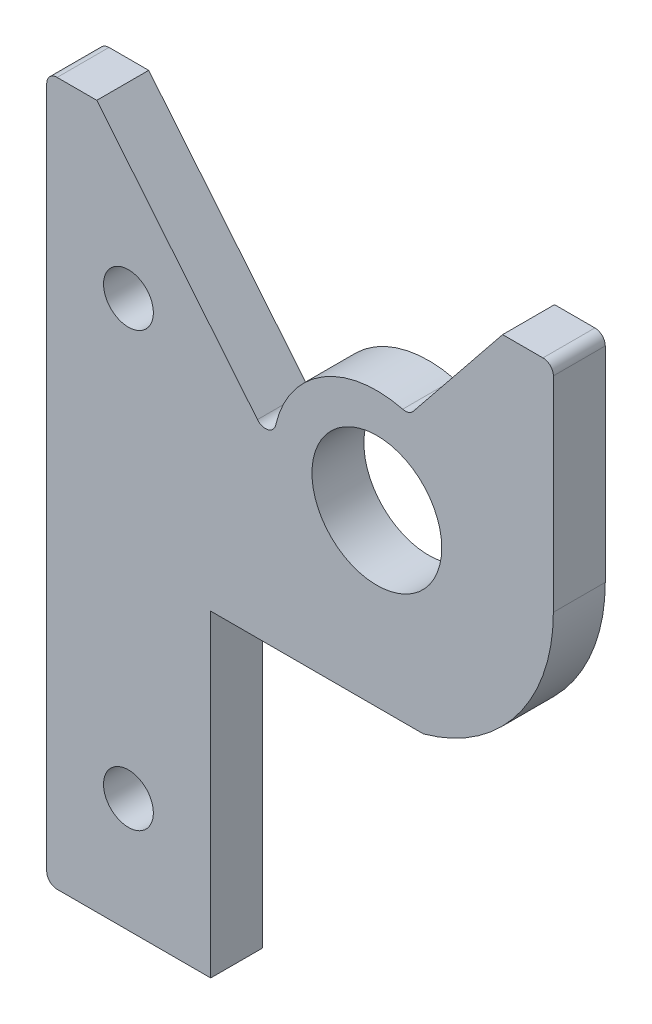
ISO-10303-21;
HEADER;
FILE_DESCRIPTION(('STEP AP214'),'2;1');
FILE_NAME('part.step','',(''),(''),'','','');
FILE_SCHEMA(('AUTOMOTIVE_DESIGN { 1 0 10303 214 1 1 1 1 }'));
ENDSEC;
DATA;
#1=APPLICATION_CONTEXT('core data for automotive mechanical design processes');
#2=APPLICATION_PROTOCOL_DEFINITION('international standard','automotive_design',2000,#1);
#3=PRODUCT_CONTEXT('',#1,'mechanical');
#4=PRODUCT('Part','Part','',(#3));
#5=PRODUCT_RELATED_PRODUCT_CATEGORY('part','',(#4));
#6=PRODUCT_DEFINITION_FORMATION('','',#4);
#7=PRODUCT_DEFINITION_CONTEXT('part definition',#1,'design');
#8=PRODUCT_DEFINITION('design','',#6,#7);
#9=PRODUCT_DEFINITION_SHAPE('','',#8);
#10=(LENGTH_UNIT() NAMED_UNIT(*) SI_UNIT(.MILLI.,.METRE.));
#11=(NAMED_UNIT(*) PLANE_ANGLE_UNIT() SI_UNIT($,.RADIAN.));
#12=(NAMED_UNIT(*) SI_UNIT($,.STERADIAN.) SOLID_ANGLE_UNIT());
#13=UNCERTAINTY_MEASURE_WITH_UNIT(LENGTH_MEASURE(1.E-05),#10,'distance_accuracy_value','');
#14=(GEOMETRIC_REPRESENTATION_CONTEXT(3) GLOBAL_UNCERTAINTY_ASSIGNED_CONTEXT((#13)) GLOBAL_UNIT_ASSIGNED_CONTEXT((#10,
#11,#12)) REPRESENTATION_CONTEXT('',''));
#15=CARTESIAN_POINT('',(0.,0.,0.));
#16=DIRECTION('',(0.,0.,1.));
#17=DIRECTION('',(1.,0.,0.));
#18=AXIS2_PLACEMENT_3D('',#15,#16,#17);
#19=CARTESIAN_POINT('',(-40.3774369352808,0.,6.35));
#20=DIRECTION('',(-1.,0.,0.));
#21=DIRECTION('',(0.,0.,1.));
#22=AXIS2_PLACEMENT_3D('',#19,#20,#21);
#23=PLANE('',#22);
#24=DIRECTION('',(0.,1.,0.));
#25=VECTOR('',#24,1.);
#26=CARTESIAN_POINT('',(-40.3774369352808,0.,0.));
#27=LINE('',#26,#25);
#28=CARTESIAN_POINT('',(-40.3774369352808,-58.42,0.));
#29=VERTEX_POINT('',#28);
#30=CARTESIAN_POINT('',(-40.3774369352808,25.0423969023602,0.));
#31=VERTEX_POINT('',#30);
#32=EDGE_CURVE('E205',#29,#31,#27,.T.);
#33=ORIENTED_EDGE('',*,*,#32,.F.);
#34=DIRECTION('',(0.,0.,-1.));
#35=VECTOR('',#34,1.);
#36=CARTESIAN_POINT('',(-40.3774369352808,-58.42,6.35));
#37=LINE('',#36,#35);
#38=CARTESIAN_POINT('',(-40.3774369352808,-58.42,6.35));
#39=VERTEX_POINT('',#38);
#40=EDGE_CURVE('E11',#39,#29,#37,.T.);
#41=ORIENTED_EDGE('',*,*,#40,.F.);
#42=DIRECTION('',(0.,1.,0.));
#43=VECTOR('',#42,1.);
#44=CARTESIAN_POINT('',(-40.3774369352808,0.,6.35));
#45=LINE('',#44,#43);
#46=CARTESIAN_POINT('',(-40.3774369352808,25.0423969023602,6.35));
#47=VERTEX_POINT('',#46);
#48=EDGE_CURVE('E272',#39,#47,#45,.T.);
#49=ORIENTED_EDGE('',*,*,#48,.T.);
#50=DIRECTION('',(0.,0.,-1.));
#51=VECTOR('',#50,1.);
#52=CARTESIAN_POINT('',(-40.3774369352808,25.0423969023602,6.35));
#53=LINE('',#52,#51);
#54=EDGE_CURVE('E62',#47,#31,#53,.T.);
#55=ORIENTED_EDGE('',*,*,#54,.T.);
#56=EDGE_LOOP('',(#33,#41,#49,#55));
#57=FACE_BOUND('',#56,.T.);
#58=ADVANCED_FACE('F45',(#57),#23,.T.);
#59=CARTESIAN_POINT('',(-39.1074369352808,-58.42,6.35));
#60=DIRECTION('',(0.,0.,-1.));
#61=DIRECTION('',(-1.,0.,0.));
#62=AXIS2_PLACEMENT_3D('',#59,#60,#61);
#63=CYLINDRICAL_SURFACE('',#62,1.27);
#64=CARTESIAN_POINT('',(-39.1074369352808,-58.42,0.));
#65=DIRECTION('',(0.,0.,1.));
#66=DIRECTION('',(1.,0.,0.));
#67=AXIS2_PLACEMENT_3D('',#64,#65,#66);
#68=CIRCLE('',#67,1.27);
#69=CARTESIAN_POINT('',(-39.1074369352808,-59.69,0.));
#70=VERTEX_POINT('',#69);
#71=EDGE_CURVE('E208',#29,#70,#68,.T.);
#72=ORIENTED_EDGE('',*,*,#71,.T.);
#73=DIRECTION('',(0.,0.,-1.));
#74=VECTOR('',#73,1.);
#75=CARTESIAN_POINT('',(-39.1074369352808,-59.69,6.35));
#76=LINE('',#75,#74);
#77=CARTESIAN_POINT('',(-39.1074369352808,-59.69,6.35));
#78=VERTEX_POINT('',#77);
#79=EDGE_CURVE('E54',#78,#70,#76,.T.);
#80=ORIENTED_EDGE('',*,*,#79,.F.);
#81=CARTESIAN_POINT('',(-39.1074369352808,-58.42,6.35));
#82=DIRECTION('',(0.,0.,1.));
#83=DIRECTION('',(1.,0.,0.));
#84=AXIS2_PLACEMENT_3D('',#81,#82,#83);
#85=CIRCLE('',#84,1.27);
#86=EDGE_CURVE('E643',#39,#78,#85,.T.);
#87=ORIENTED_EDGE('',*,*,#86,.F.);
#88=ORIENTED_EDGE('',*,*,#40,.T.);
#89=EDGE_LOOP('',(#72,#80,#87,#88));
#90=FACE_BOUND('',#89,.T.);
#91=ADVANCED_FACE('F392',(#90),#63,.T.);
#92=CARTESIAN_POINT('',(0.,-59.69,6.35));
#93=DIRECTION('',(0.,1.,0.));
#94=DIRECTION('',(0.,0.,1.));
#95=AXIS2_PLACEMENT_3D('',#92,#93,#94);
#96=PLANE('',#95);
#97=DIRECTION('',(1.,0.,0.));
#98=VECTOR('',#97,1.);
#99=CARTESIAN_POINT('',(0.,-59.69,0.));
#100=LINE('',#99,#98);
#101=CARTESIAN_POINT('',(-20.3190569352808,-59.69,0.));
#102=VERTEX_POINT('',#101);
#103=EDGE_CURVE('E211',#70,#102,#100,.T.);
#104=ORIENTED_EDGE('',*,*,#103,.T.);
#105=DIRECTION('',(0.,0.,-1.));
#106=VECTOR('',#105,1.);
#107=CARTESIAN_POINT('',(-20.3190569352808,-59.69,6.35));
#108=LINE('',#107,#106);
#109=CARTESIAN_POINT('',(-20.3190569352808,-59.69,6.35));
#110=VERTEX_POINT('',#109);
#111=EDGE_CURVE('E309',#110,#102,#108,.T.);
#112=ORIENTED_EDGE('',*,*,#111,.F.);
#113=DIRECTION('',(1.,0.,0.));
#114=VECTOR('',#113,1.);
#115=CARTESIAN_POINT('',(0.,-59.69,6.35));
#116=LINE('',#115,#114);
#117=EDGE_CURVE('E320',#78,#110,#116,.T.);
#118=ORIENTED_EDGE('',*,*,#117,.F.);
#119=ORIENTED_EDGE('',*,*,#79,.T.);
#120=EDGE_LOOP('',(#104,#112,#118,#119));
#121=FACE_BOUND('',#120,.T.);
#122=ADVANCED_FACE('F318',(#121),#96,.F.);
#123=CARTESIAN_POINT('',(-20.3190569352808,0.,6.35));
#124=DIRECTION('',(-1.,0.,0.));
#125=DIRECTION('',(0.,0.,1.));
#126=AXIS2_PLACEMENT_3D('',#123,#124,#125);
#127=PLANE('',#126);
#128=DIRECTION('',(0.,1.,0.));
#129=VECTOR('',#128,1.);
#130=CARTESIAN_POINT('',(-20.3190569352808,0.,0.));
#131=LINE('',#130,#129);
#132=CARTESIAN_POINT('',(-20.3190569352808,-20.828,0.));
#133=VERTEX_POINT('',#132);
#134=EDGE_CURVE('E214',#102,#133,#131,.T.);
#135=ORIENTED_EDGE('',*,*,#134,.T.);
#136=DIRECTION('',(0.,0.,-1.));
#137=VECTOR('',#136,1.);
#138=CARTESIAN_POINT('',(-20.3190569352808,-20.828,6.35));
#139=LINE('',#138,#137);
#140=CARTESIAN_POINT('',(-20.3190569352808,-20.828,6.35));
#141=VERTEX_POINT('',#140);
#142=EDGE_CURVE('E305',#141,#133,#139,.T.);
#143=ORIENTED_EDGE('',*,*,#142,.F.);
#144=DIRECTION('',(0.,1.,0.));
#145=VECTOR('',#144,1.);
#146=CARTESIAN_POINT('',(-20.3190569352808,0.,6.35));
#147=LINE('',#146,#145);
#148=EDGE_CURVE('E341',#110,#141,#147,.T.);
#149=ORIENTED_EDGE('',*,*,#148,.F.);
#150=ORIENTED_EDGE('',*,*,#111,.T.);
#151=EDGE_LOOP('',(#135,#143,#149,#150));
#152=FACE_BOUND('',#151,.T.);
#153=ADVANCED_FACE('F330',(#152),#127,.F.);
#154=CARTESIAN_POINT('',(0.,-20.828,6.35));
#155=DIRECTION('',(0.,1.,0.));
#156=DIRECTION('',(0.,0.,1.));
#157=AXIS2_PLACEMENT_3D('',#154,#155,#156);
#158=PLANE('',#157);
#159=DIRECTION('',(1.,0.,0.));
#160=VECTOR('',#159,1.);
#161=CARTESIAN_POINT('',(0.,-20.828,0.));
#162=LINE('',#161,#160);
#163=CARTESIAN_POINT('',(5.68528943854224,-20.828,0.));
#164=VERTEX_POINT('',#163);
#165=EDGE_CURVE('E217',#133,#164,#162,.T.);
#166=ORIENTED_EDGE('',*,*,#165,.T.);
#167=DIRECTION('',(0.,0.,-1.));
#168=VECTOR('',#167,1.);
#169=CARTESIAN_POINT('',(5.68528943854224,-20.828,6.35));
#170=LINE('',#169,#168);
#171=CARTESIAN_POINT('',(5.68528943854224,-20.828,6.35));
#172=VERTEX_POINT('',#171);
#173=EDGE_CURVE('E302',#172,#164,#170,.T.);
#174=ORIENTED_EDGE('',*,*,#173,.F.);
#175=DIRECTION('',(1.,0.,0.));
#176=VECTOR('',#175,1.);
#177=CARTESIAN_POINT('',(0.,-20.828,6.35));
#178=LINE('',#177,#176);
#179=EDGE_CURVE('E336',#141,#172,#178,.T.);
#180=ORIENTED_EDGE('',*,*,#179,.F.);
#181=ORIENTED_EDGE('',*,*,#142,.T.);
#182=EDGE_LOOP('',(#166,#174,#180,#181));
#183=FACE_BOUND('',#182,.T.);
#184=ADVANCED_FACE('F334',(#183),#158,.F.);
#185=CARTESIAN_POINT('',(0.,0.,6.35));
#186=DIRECTION('',(0.,0.,-1.));
#187=DIRECTION('',(-1.,0.,0.));
#188=AXIS2_PLACEMENT_3D('',#185,#186,#187);
#189=CYLINDRICAL_SURFACE('',#188,21.59);
#190=CARTESIAN_POINT('',(0.,0.,0.));
#191=DIRECTION('',(0.,0.,1.));
#192=DIRECTION('',(1.,0.,0.));
#193=AXIS2_PLACEMENT_3D('',#190,#191,#192);
#194=CIRCLE('',#193,21.59);
#195=CARTESIAN_POINT('',(21.59,0.,0.));
#196=VERTEX_POINT('',#195);
#197=EDGE_CURVE('E221',#196,#164,#194,.F.);
#198=ORIENTED_EDGE('',*,*,#197,.F.);
#199=DIRECTION('',(0.,0.,-1.));
#200=VECTOR('',#199,1.);
#201=CARTESIAN_POINT('',(21.59,0.,6.35));
#202=LINE('',#201,#200);
#203=CARTESIAN_POINT('',(21.59,0.,6.35));
#204=VERTEX_POINT('',#203);
#205=EDGE_CURVE('E299',#204,#196,#202,.T.);
#206=ORIENTED_EDGE('',*,*,#205,.F.);
#207=CARTESIAN_POINT('',(0.,0.,6.35));
#208=DIRECTION('',(0.,0.,1.));
#209=DIRECTION('',(1.,0.,0.));
#210=AXIS2_PLACEMENT_3D('',#207,#208,#209);
#211=CIRCLE('',#210,21.59);
#212=EDGE_CURVE('E340',#204,#172,#211,.F.);
#213=ORIENTED_EDGE('',*,*,#212,.T.);
#214=ORIENTED_EDGE('',*,*,#173,.T.);
#215=EDGE_LOOP('',(#198,#206,#213,#214));
#216=FACE_BOUND('',#215,.T.);
#217=ADVANCED_FACE('F549',(#216),#189,.T.);
#218=CARTESIAN_POINT('',(21.59,0.,6.35));
#219=DIRECTION('',(1.,0.,0.));
#220=DIRECTION('',(0.,0.,-1.));
#221=AXIS2_PLACEMENT_3D('',#218,#219,#220);
#222=PLANE('',#221);
#223=DIRECTION('',(0.,-1.,0.));
#224=VECTOR('',#223,1.);
#225=CARTESIAN_POINT('',(21.59,0.,0.));
#226=LINE('',#225,#224);
#227=CARTESIAN_POINT('',(21.59,25.0423969023602,0.));
#228=VERTEX_POINT('',#227);
#229=EDGE_CURVE('E225',#228,#196,#226,.T.);
#230=ORIENTED_EDGE('',*,*,#229,.F.);
#231=DIRECTION('',(0.,0.,-1.));
#232=VECTOR('',#231,1.);
#233=CARTESIAN_POINT('',(21.59,25.0423969023602,6.35));
#234=LINE('',#233,#232);
#235=CARTESIAN_POINT('',(21.59,25.0423969023602,6.35));
#236=VERTEX_POINT('',#235);
#237=EDGE_CURVE('E296',#236,#228,#234,.T.);
#238=ORIENTED_EDGE('',*,*,#237,.F.);
#239=DIRECTION('',(0.,-1.,0.));
#240=VECTOR('',#239,1.);
#241=CARTESIAN_POINT('',(21.59,0.,6.35));
#242=LINE('',#241,#240);
#243=EDGE_CURVE('E345',#236,#204,#242,.T.);
#244=ORIENTED_EDGE('',*,*,#243,.T.);
#245=ORIENTED_EDGE('',*,*,#205,.T.);
#246=EDGE_LOOP('',(#230,#238,#244,#245));
#247=FACE_BOUND('',#246,.T.);
#248=ADVANCED_FACE('F538',(#247),#222,.T.);
#249=CARTESIAN_POINT('',(20.32,25.0423969023602,6.35));
#250=DIRECTION('',(0.,0.,-1.));
#251=DIRECTION('',(-1.,0.,0.));
#252=AXIS2_PLACEMENT_3D('',#249,#250,#251);
#253=CYLINDRICAL_SURFACE('',#252,1.27);
#254=CARTESIAN_POINT('',(20.32,25.0423969023602,0.));
#255=DIRECTION('',(0.,0.,1.));
#256=DIRECTION('',(1.,0.,0.));
#257=AXIS2_PLACEMENT_3D('',#254,#255,#256);
#258=CIRCLE('',#257,1.27);
#259=CARTESIAN_POINT('',(20.32,26.3123969023602,0.));
#260=VERTEX_POINT('',#259);
#261=EDGE_CURVE('E229',#228,#260,#258,.T.);
#262=ORIENTED_EDGE('',*,*,#261,.T.);
#263=DIRECTION('',(0.,0.,-1.));
#264=VECTOR('',#263,1.);
#265=CARTESIAN_POINT('',(20.32,26.3123969023602,6.35));
#266=LINE('',#265,#264);
#267=CARTESIAN_POINT('',(20.32,26.3123969023602,6.35));
#268=VERTEX_POINT('',#267);
#269=EDGE_CURVE('E292',#268,#260,#266,.T.);
#270=ORIENTED_EDGE('',*,*,#269,.F.);
#271=CARTESIAN_POINT('',(20.32,25.0423969023602,6.35));
#272=DIRECTION('',(0.,0.,1.));
#273=DIRECTION('',(1.,0.,0.));
#274=AXIS2_PLACEMENT_3D('',#271,#272,#273);
#275=CIRCLE('',#274,1.27);
#276=EDGE_CURVE('E353',#236,#268,#275,.T.);
#277=ORIENTED_EDGE('',*,*,#276,.F.);
#278=ORIENTED_EDGE('',*,*,#237,.T.);
#279=EDGE_LOOP('',(#262,#270,#277,#278));
#280=FACE_BOUND('',#279,.T.);
#281=ADVANCED_FACE('F527',(#280),#253,.T.);
#282=CARTESIAN_POINT('',(0.,26.3123969023602,6.35));
#283=DIRECTION('',(0.,-1.,0.));
#284=DIRECTION('',(0.,0.,-1.));
#285=AXIS2_PLACEMENT_3D('',#282,#283,#284);
#286=PLANE('',#285);
#287=DIRECTION('',(-1.,0.,0.));
#288=VECTOR('',#287,1.);
#289=CARTESIAN_POINT('',(0.,26.3123969023602,0.));
#290=LINE('',#289,#288);
#291=CARTESIAN_POINT('',(15.3840271810413,26.3123969023602,0.));
#292=VERTEX_POINT('',#291);
#293=EDGE_CURVE('E232',#260,#292,#290,.T.);
#294=ORIENTED_EDGE('',*,*,#293,.T.);
#295=DIRECTION('',(0.,0.,-1.));
#296=VECTOR('',#295,1.);
#297=CARTESIAN_POINT('',(15.3840271810413,26.3123969023602,6.35));
#298=LINE('',#297,#296);
#299=CARTESIAN_POINT('',(15.3840271810413,26.3123969023602,6.35));
#300=VERTEX_POINT('',#299);
#301=EDGE_CURVE('E288',#300,#292,#298,.T.);
#302=ORIENTED_EDGE('',*,*,#301,.F.);
#303=DIRECTION('',(-1.,0.,0.));
#304=VECTOR('',#303,1.);
#305=CARTESIAN_POINT('',(0.,26.3123969023602,6.35));
#306=LINE('',#305,#304);
#307=EDGE_CURVE('E356',#268,#300,#306,.T.);
#308=ORIENTED_EDGE('',*,*,#307,.F.);
#309=ORIENTED_EDGE('',*,*,#269,.T.);
#310=EDGE_LOOP('',(#294,#302,#308,#309));
#311=FACE_BOUND('',#310,.T.);
#312=ADVANCED_FACE('F516',(#311),#286,.F.);
#313=CARTESIAN_POINT('',(-3.50791757364985,2.82110422415776,6.35));
#314=DIRECTION('',(0.779265702235837,-0.626693677420546,0.));
#315=DIRECTION('',(0.626693677420546,0.779265702235838,0.));
#316=AXIS2_PLACEMENT_3D('',#313,#314,#315);
#317=PLANE('',#316);
#318=DIRECTION('',(-0.626693677420546,-0.779265702235837,0.));
#319=VECTOR('',#318,1.);
#320=CARTESIAN_POINT('',(-3.50791757364985,2.82110422415776,0.));
#321=LINE('',#320,#319);
#322=CARTESIAN_POINT('',(4.46489462313455,12.7349414291124,0.));
#323=VERTEX_POINT('',#322);
#324=EDGE_CURVE('E235',#292,#323,#321,.T.);
#325=ORIENTED_EDGE('',*,*,#324,.T.);
#326=DIRECTION('',(0.,0.,-1.));
#327=VECTOR('',#326,1.);
#328=CARTESIAN_POINT('',(4.46489462313455,12.7349414291124,6.35));
#329=LINE('',#328,#327);
#330=CARTESIAN_POINT('',(4.46489462313455,12.7349414291124,6.35));
#331=VERTEX_POINT('',#330);
#332=EDGE_CURVE('E285',#331,#323,#329,.T.);
#333=ORIENTED_EDGE('',*,*,#332,.F.);
#334=DIRECTION('',(-0.626693677420546,-0.779265702235837,0.));
#335=VECTOR('',#334,1.);
#336=CARTESIAN_POINT('',(-3.50791757364985,2.82110422415776,6.35));
#337=LINE('',#336,#335);
#338=EDGE_CURVE('E359',#300,#331,#337,.T.);
#339=ORIENTED_EDGE('',*,*,#338,.F.);
#340=ORIENTED_EDGE('',*,*,#301,.T.);
#341=EDGE_LOOP('',(#325,#333,#339,#340));
#342=FACE_BOUND('',#341,.T.);
#343=ADVANCED_FACE('F506',(#342),#317,.F.);
#344=CARTESIAN_POINT('',(3.47522718129504,13.5308423994365,6.35));
#345=DIRECTION('',(0.,0.,-1.));
#346=DIRECTION('',(-1.,0.,0.));
#347=AXIS2_PLACEMENT_3D('',#344,#345,#346);
#348=CYLINDRICAL_SURFACE('',#347,1.27);
#349=CARTESIAN_POINT('',(3.47522718129504,13.5308423994365,0.));
#350=DIRECTION('',(0.,0.,1.));
#351=DIRECTION('',(1.,0.,0.));
#352=AXIS2_PLACEMENT_3D('',#349,#350,#351);
#353=CIRCLE('',#352,1.27);
#354=CARTESIAN_POINT('',(3.15929743754094,12.3007658176695,0.));
#355=VERTEX_POINT('',#354);
#356=EDGE_CURVE('E239',#355,#323,#353,.T.);
#357=ORIENTED_EDGE('',*,*,#356,.F.);
#358=DIRECTION('',(0.,0.,-1.));
#359=VECTOR('',#358,1.);
#360=CARTESIAN_POINT('',(3.15929743754094,12.3007658176695,6.35));
#361=LINE('',#360,#359);
#362=CARTESIAN_POINT('',(3.15929743754094,12.3007658176695,6.35));
#363=VERTEX_POINT('',#362);
#364=EDGE_CURVE('E282',#363,#355,#361,.T.);
#365=ORIENTED_EDGE('',*,*,#364,.F.);
#366=CARTESIAN_POINT('',(3.47522718129504,13.5308423994365,6.35));
#367=DIRECTION('',(0.,0.,1.));
#368=DIRECTION('',(1.,0.,0.));
#369=AXIS2_PLACEMENT_3D('',#366,#367,#368);
#370=CIRCLE('',#369,1.27);
#371=EDGE_CURVE('E362',#363,#331,#370,.T.);
#372=ORIENTED_EDGE('',*,*,#371,.T.);
#373=ORIENTED_EDGE('',*,*,#332,.T.);
#374=EDGE_LOOP('',(#357,#365,#372,#373));
#375=FACE_BOUND('',#374,.T.);
#376=ADVANCED_FACE('F378',(#375),#348,.F.);
#377=CARTESIAN_POINT('',(0.,0.,6.35));
#378=DIRECTION('',(0.,0.,-1.));
#379=DIRECTION('',(-1.,0.,0.));
#380=AXIS2_PLACEMENT_3D('',#377,#378,#379);
#381=CYLINDRICAL_SURFACE('',#380,12.7);
#382=CARTESIAN_POINT('',(0.,0.,0.));
#383=DIRECTION('',(0.,0.,1.));
#384=DIRECTION('',(1.,0.,0.));
#385=AXIS2_PLACEMENT_3D('',#382,#383,#384);
#386=CIRCLE('',#385,12.7);
#387=CARTESIAN_POINT('',(-12.3786058014155,2.83903476786794,0.));
#388=VERTEX_POINT('',#387);
#389=EDGE_CURVE('E243',#388,#355,#386,.F.);
#390=ORIENTED_EDGE('',*,*,#389,.F.);
#391=DIRECTION('',(0.,0.,-1.));
#392=VECTOR('',#391,1.);
#393=CARTESIAN_POINT('',(-12.3786058014155,2.83903476786794,6.35));
#394=LINE('',#393,#392);
#395=CARTESIAN_POINT('',(-12.3786058014155,2.83903476786794,6.35));
#396=VERTEX_POINT('',#395);
#397=EDGE_CURVE('E279',#396,#388,#394,.T.);
#398=ORIENTED_EDGE('',*,*,#397,.F.);
#399=CARTESIAN_POINT('',(0.,0.,6.35));
#400=DIRECTION('',(0.,0.,1.));
#401=DIRECTION('',(1.,0.,0.));
#402=AXIS2_PLACEMENT_3D('',#399,#400,#401);
#403=CIRCLE('',#402,12.7);
#404=EDGE_CURVE('E366',#396,#363,#403,.F.);
#405=ORIENTED_EDGE('',*,*,#404,.T.);
#406=ORIENTED_EDGE('',*,*,#364,.T.);
#407=EDGE_LOOP('',(#390,#398,#405,#406));
#408=FACE_BOUND('',#407,.T.);
#409=ADVANCED_FACE('F372',(#408),#381,.T.);
#410=CARTESIAN_POINT('',(-13.616466381557,3.12293824465473,6.35));
#411=DIRECTION('',(0.,0.,-1.));
#412=DIRECTION('',(-1.,0.,0.));
#413=AXIS2_PLACEMENT_3D('',#410,#411,#412);
#414=CYLINDRICAL_SURFACE('',#413,1.27);
#415=CARTESIAN_POINT('',(-13.616466381557,3.12293824465473,0.));
#416=DIRECTION('',(0.,0.,1.));
#417=DIRECTION('',(1.,0.,0.));
#418=AXIS2_PLACEMENT_3D('',#415,#416,#417);
#419=CIRCLE('',#418,1.27);
#420=CARTESIAN_POINT('',(-14.5989241801182,2.31815462525987,0.));
#421=VERTEX_POINT('',#420);
#422=EDGE_CURVE('E247',#388,#421,#419,.F.);
#423=ORIENTED_EDGE('',*,*,#422,.T.);
#424=DIRECTION('',(0.,0.,-1.));
#425=VECTOR('',#424,1.);
#426=CARTESIAN_POINT('',(-14.5989241801182,2.31815462525987,6.35));
#427=LINE('',#426,#425);
#428=CARTESIAN_POINT('',(-14.5989241801182,2.31815462525987,6.35));
#429=VERTEX_POINT('',#428);
#430=EDGE_CURVE('E170',#429,#421,#427,.T.);
#431=ORIENTED_EDGE('',*,*,#430,.F.);
#432=CARTESIAN_POINT('',(-13.616466381557,3.12293824465473,6.35));
#433=DIRECTION('',(0.,0.,1.));
#434=DIRECTION('',(1.,0.,0.));
#435=AXIS2_PLACEMENT_3D('',#432,#433,#434);
#436=CIRCLE('',#435,1.27);
#437=EDGE_CURVE('E181',#396,#429,#436,.F.);
#438=ORIENTED_EDGE('',*,*,#437,.F.);
#439=ORIENTED_EDGE('',*,*,#397,.T.);
#440=EDGE_LOOP('',(#423,#431,#438,#439));
#441=FACE_BOUND('',#440,.T.);
#442=ADVANCED_FACE('F382',(#441),#414,.F.);
#443=CARTESIAN_POINT('',(-7.60018366892684,-6.22571608684082,6.35));
#444=DIRECTION('',(0.77358881776472,0.633687889287292,0.));
#445=DIRECTION('',(-0.633687889287292,0.77358881776472,0.));
#446=AXIS2_PLACEMENT_3D('',#443,#444,#445);
#447=PLANE('',#446);
#448=DIRECTION('',(0.633687889287292,-0.77358881776472,0.));
#449=VECTOR('',#448,1.);
#450=CARTESIAN_POINT('',(-7.60018366892684,-6.22571608684082,0.));
#451=LINE('',#450,#449);
#452=CARTESIAN_POINT('',(-34.2538886708899,26.3123969023602,0.));
#453=VERTEX_POINT('',#452);
#454=EDGE_CURVE('E165',#453,#421,#451,.T.);
#455=ORIENTED_EDGE('',*,*,#454,.F.);
#456=DIRECTION('',(0.,0.,-1.));
#457=VECTOR('',#456,1.);
#458=CARTESIAN_POINT('',(-34.2538886708899,26.3123969023602,6.35));
#459=LINE('',#458,#457);
#460=CARTESIAN_POINT('',(-34.2538886708899,26.3123969023602,6.35));
#461=VERTEX_POINT('',#460);
#462=EDGE_CURVE('E160',#461,#453,#459,.T.);
#463=ORIENTED_EDGE('',*,*,#462,.F.);
#464=DIRECTION('',(0.633687889287292,-0.77358881776472,0.));
#465=VECTOR('',#464,1.);
#466=CARTESIAN_POINT('',(-7.60018366892684,-6.22571608684082,6.35));
#467=LINE('',#466,#465);
#468=EDGE_CURVE('E163',#461,#429,#467,.T.);
#469=ORIENTED_EDGE('',*,*,#468,.T.);
#470=ORIENTED_EDGE('',*,*,#430,.T.);
#471=EDGE_LOOP('',(#455,#463,#469,#470));
#472=FACE_BOUND('',#471,.T.);
#473=ADVANCED_FACE('F162',(#472),#447,.T.);
#474=CARTESIAN_POINT('',(0.,26.3123969023602,6.35));
#475=DIRECTION('',(0.,1.,0.));
#476=DIRECTION('',(0.,0.,1.));
#477=AXIS2_PLACEMENT_3D('',#474,#475,#476);
#478=PLANE('',#477);
#479=DIRECTION('',(1.,0.,0.));
#480=VECTOR('',#479,1.);
#481=CARTESIAN_POINT('',(0.,26.3123969023602,0.));
#482=LINE('',#481,#480);
#483=CARTESIAN_POINT('',(-39.1074369352808,26.3123969023602,0.));
#484=VERTEX_POINT('',#483);
#485=EDGE_CURVE('E253',#484,#453,#482,.T.);
#486=ORIENTED_EDGE('',*,*,#485,.F.);
#487=DIRECTION('',(0.,0.,-1.));
#488=VECTOR('',#487,1.);
#489=CARTESIAN_POINT('',(-39.1074369352808,26.3123969023602,6.35));
#490=LINE('',#489,#488);
#491=CARTESIAN_POINT('',(-39.1074369352808,26.3123969023602,6.35));
#492=VERTEX_POINT('',#491);
#493=EDGE_CURVE('E111',#492,#484,#490,.T.);
#494=ORIENTED_EDGE('',*,*,#493,.F.);
#495=DIRECTION('',(1.,0.,0.));
#496=VECTOR('',#495,1.);
#497=CARTESIAN_POINT('',(0.,26.3123969023602,6.35));
#498=LINE('',#497,#496);
#499=EDGE_CURVE('E178',#492,#461,#498,.T.);
#500=ORIENTED_EDGE('',*,*,#499,.T.);
#501=ORIENTED_EDGE('',*,*,#462,.T.);
#502=EDGE_LOOP('',(#486,#494,#500,#501));
#503=FACE_BOUND('',#502,.T.);
#504=ADVANCED_FACE('F185',(#503),#478,.T.);
#505=CARTESIAN_POINT('',(0.,0.,6.35));
#506=DIRECTION('',(0.,0.,-1.));
#507=DIRECTION('',(-1.,0.,0.));
#508=AXIS2_PLACEMENT_3D('',#505,#506,#507);
#509=CYLINDRICAL_SURFACE('',#508,7.9375);
#510=CARTESIAN_POINT('',(0.,0.,6.35));
#511=DIRECTION('',(0.,0.,1.));
#512=DIRECTION('',(1.,0.,0.));
#513=AXIS2_PLACEMENT_3D('',#510,#511,#512);
#514=CIRCLE('',#513,7.9375);
#515=CARTESIAN_POINT('',(7.9375,0.,6.35));
#516=VERTEX_POINT('',#515);
#517=EDGE_CURVE('E197',#516,#516,#514,.T.);
#518=ORIENTED_EDGE('',*,*,#517,.T.);
#519=EDGE_LOOP('',(#518));
#520=FACE_BOUND('',#519,.T.);
#521=CARTESIAN_POINT('',(0.,0.,0.));
#522=DIRECTION('',(0.,0.,1.));
#523=DIRECTION('',(1.,0.,0.));
#524=AXIS2_PLACEMENT_3D('',#521,#522,#523);
#525=CIRCLE('',#524,7.9375);
#526=CARTESIAN_POINT('',(7.9375,0.,0.));
#527=VERTEX_POINT('',#526);
#528=EDGE_CURVE('E264',#527,#527,#525,.T.);
#529=ORIENTED_EDGE('',*,*,#528,.F.);
#530=EDGE_LOOP('',(#529));
#531=FACE_BOUND('',#530,.T.);
#532=ADVANCED_FACE('F407',(#520,#531),#509,.F.);
#533=CARTESIAN_POINT('',(-30.3825369352808,7.26239690236022,6.35));
#534=DIRECTION('',(0.,0.,-1.));
#535=DIRECTION('',(-1.,0.,0.));
#536=AXIS2_PLACEMENT_3D('',#533,#534,#535);
#537=CYLINDRICAL_SURFACE('',#536,3.048);
#538=CARTESIAN_POINT('',(-30.3825369352808,7.26239690236022,6.35));
#539=DIRECTION('',(0.,0.,1.));
#540=DIRECTION('',(1.,0.,0.));
#541=AXIS2_PLACEMENT_3D('',#538,#539,#540);
#542=CIRCLE('',#541,3.048);
#543=CARTESIAN_POINT('',(-27.3345369352808,7.26239690236022,6.35));
#544=VERTEX_POINT('',#543);
#545=EDGE_CURVE('E190',#544,#544,#542,.T.);
#546=ORIENTED_EDGE('',*,*,#545,.T.);
#547=EDGE_LOOP('',(#546));
#548=FACE_BOUND('',#547,.T.);
#549=CARTESIAN_POINT('',(-30.3825369352808,7.26239690236022,0.));
#550=DIRECTION('',(0.,0.,1.));
#551=DIRECTION('',(1.,0.,0.));
#552=AXIS2_PLACEMENT_3D('',#549,#550,#551);
#553=CIRCLE('',#552,3.048);
#554=CARTESIAN_POINT('',(-27.3345369352808,7.26239690236022,0.));
#555=VERTEX_POINT('',#554);
#556=EDGE_CURVE('E260',#555,#555,#553,.T.);
#557=ORIENTED_EDGE('',*,*,#556,.F.);
#558=EDGE_LOOP('',(#557));
#559=FACE_BOUND('',#558,.T.);
#560=ADVANCED_FACE('F399',(#548,#559),#537,.F.);
#561=CARTESIAN_POINT('',(-39.1074369352808,25.0423969023602,6.35));
#562=DIRECTION('',(0.,0.,-1.));
#563=DIRECTION('',(-1.,0.,0.));
#564=AXIS2_PLACEMENT_3D('',#561,#562,#563);
#565=CYLINDRICAL_SURFACE('',#564,1.27);
#566=CARTESIAN_POINT('',(-39.1074369352808,25.0423969023602,0.));
#567=DIRECTION('',(0.,0.,1.));
#568=DIRECTION('',(1.,0.,0.));
#569=AXIS2_PLACEMENT_3D('',#566,#567,#568);
#570=CIRCLE('',#569,1.27);
#571=EDGE_CURVE('E256',#31,#484,#570,.F.);
#572=ORIENTED_EDGE('',*,*,#571,.F.);
#573=ORIENTED_EDGE('',*,*,#54,.F.);
#574=CARTESIAN_POINT('',(-39.1074369352808,25.0423969023602,6.35));
#575=DIRECTION('',(0.,0.,1.));
#576=DIRECTION('',(1.,0.,0.));
#577=AXIS2_PLACEMENT_3D('',#574,#575,#576);
#578=CIRCLE('',#577,1.27);
#579=EDGE_CURVE('E187',#47,#492,#578,.F.);
#580=ORIENTED_EDGE('',*,*,#579,.T.);
#581=ORIENTED_EDGE('',*,*,#493,.T.);
#582=EDGE_LOOP('',(#572,#573,#580,#581));
#583=FACE_BOUND('',#582,.T.);
#584=ADVANCED_FACE('F396',(#583),#565,.T.);
#585=CARTESIAN_POINT('',(-30.3825369352808,-45.72,6.35));
#586=DIRECTION('',(0.,0.,-1.));
#587=DIRECTION('',(-1.,0.,0.));
#588=AXIS2_PLACEMENT_3D('',#585,#586,#587);
#589=CYLINDRICAL_SURFACE('',#588,3.048);
#590=CARTESIAN_POINT('',(-30.3825369352808,-45.72,6.35));
#591=DIRECTION('',(0.,0.,1.));
#592=DIRECTION('',(1.,0.,0.));
#593=AXIS2_PLACEMENT_3D('',#590,#591,#592);
#594=CIRCLE('',#593,3.048);
#595=CARTESIAN_POINT('',(-27.3345369352808,-45.72,6.35));
#596=VERTEX_POINT('',#595);
#597=EDGE_CURVE('E201',#596,#596,#594,.T.);
#598=ORIENTED_EDGE('',*,*,#597,.T.);
#599=EDGE_LOOP('',(#598));
#600=FACE_BOUND('',#599,.T.);
#601=CARTESIAN_POINT('',(-30.3825369352808,-45.72,0.));
#602=DIRECTION('',(0.,0.,1.));
#603=DIRECTION('',(1.,0.,0.));
#604=AXIS2_PLACEMENT_3D('',#601,#602,#603);
#605=CIRCLE('',#604,3.048);
#606=CARTESIAN_POINT('',(-27.3345369352808,-45.72,0.));
#607=VERTEX_POINT('',#606);
#608=EDGE_CURVE('E268',#607,#607,#605,.T.);
#609=ORIENTED_EDGE('',*,*,#608,.F.);
#610=EDGE_LOOP('',(#609));
#611=FACE_BOUND('',#610,.T.);
#612=ADVANCED_FACE('F398',(#600,#611),#589,.F.);
#613=CARTESIAN_POINT('',(0.,0.,6.35));
#614=DIRECTION('',(0.,0.,1.));
#615=DIRECTION('',(1.,0.,0.));
#616=AXIS2_PLACEMENT_3D('',#613,#614,#615);
#617=PLANE('',#616);
#618=ORIENTED_EDGE('',*,*,#48,.F.);
#619=ORIENTED_EDGE('',*,*,#86,.T.);
#620=ORIENTED_EDGE('',*,*,#117,.T.);
#621=ORIENTED_EDGE('',*,*,#148,.T.);
#622=ORIENTED_EDGE('',*,*,#179,.T.);
#623=ORIENTED_EDGE('',*,*,#212,.F.);
#624=ORIENTED_EDGE('',*,*,#243,.F.);
#625=ORIENTED_EDGE('',*,*,#276,.T.);
#626=ORIENTED_EDGE('',*,*,#307,.T.);
#627=ORIENTED_EDGE('',*,*,#338,.T.);
#628=ORIENTED_EDGE('',*,*,#371,.F.);
#629=ORIENTED_EDGE('',*,*,#404,.F.);
#630=ORIENTED_EDGE('',*,*,#437,.T.);
#631=ORIENTED_EDGE('',*,*,#468,.F.);
#632=ORIENTED_EDGE('',*,*,#499,.F.);
#633=ORIENTED_EDGE('',*,*,#579,.F.);
#634=EDGE_LOOP('',(#618,#619,#620,#621,#622,#623,#624,#625,#626,#627,#628,#629,#630,#631,#632,#633));
#635=FACE_BOUND('',#634,.T.);
#636=ORIENTED_EDGE('',*,*,#545,.F.);
#637=EDGE_LOOP('',(#636));
#638=FACE_BOUND('',#637,.T.);
#639=ORIENTED_EDGE('',*,*,#517,.F.);
#640=EDGE_LOOP('',(#639));
#641=FACE_BOUND('',#640,.T.);
#642=ORIENTED_EDGE('',*,*,#597,.F.);
#643=EDGE_LOOP('',(#642));
#644=FACE_BOUND('',#643,.T.);
#645=ADVANCED_FACE('F175',(#635,#638,#641,#644),#617,.T.);
#646=CARTESIAN_POINT('',(0.,0.,0.));
#647=DIRECTION('',(0.,0.,1.));
#648=DIRECTION('',(1.,0.,0.));
#649=AXIS2_PLACEMENT_3D('',#646,#647,#648);
#650=PLANE('',#649);
#651=ORIENTED_EDGE('',*,*,#32,.T.);
#652=ORIENTED_EDGE('',*,*,#571,.T.);
#653=ORIENTED_EDGE('',*,*,#485,.T.);
#654=ORIENTED_EDGE('',*,*,#454,.T.);
#655=ORIENTED_EDGE('',*,*,#422,.F.);
#656=ORIENTED_EDGE('',*,*,#389,.T.);
#657=ORIENTED_EDGE('',*,*,#356,.T.);
#658=ORIENTED_EDGE('',*,*,#324,.F.);
#659=ORIENTED_EDGE('',*,*,#293,.F.);
#660=ORIENTED_EDGE('',*,*,#261,.F.);
#661=ORIENTED_EDGE('',*,*,#229,.T.);
#662=ORIENTED_EDGE('',*,*,#197,.T.);
#663=ORIENTED_EDGE('',*,*,#165,.F.);
#664=ORIENTED_EDGE('',*,*,#134,.F.);
#665=ORIENTED_EDGE('',*,*,#103,.F.);
#666=ORIENTED_EDGE('',*,*,#71,.F.);
#667=EDGE_LOOP('',(#651,#652,#653,#654,#655,#656,#657,#658,#659,#660,#661,#662,#663,#664,#665,#666));
#668=FACE_BOUND('',#667,.T.);
#669=ORIENTED_EDGE('',*,*,#556,.T.);
#670=EDGE_LOOP('',(#669));
#671=FACE_BOUND('',#670,.T.);
#672=ORIENTED_EDGE('',*,*,#528,.T.);
#673=EDGE_LOOP('',(#672));
#674=FACE_BOUND('',#673,.T.);
#675=ORIENTED_EDGE('',*,*,#608,.T.);
#676=EDGE_LOOP('',(#675));
#677=FACE_BOUND('',#676,.T.);
#678=ADVANCED_FACE('F325',(#668,#671,#674,#677),#650,.F.);
#679=CLOSED_SHELL('',(#58,#91,#122,#153,#184,#217,#248,#281,#312,#343,#376,#409,#442,#473,#504,
#532,#560,#584,#612,#645,#678));
#680=MANIFOLD_SOLID_BREP('B2',#679);
#681=ADVANCED_BREP_SHAPE_REPRESENTATION('',(#18,#680),#14);
#682=SHAPE_DEFINITION_REPRESENTATION(#9,#681);
ENDSEC;
END-ISO-10303-21;
